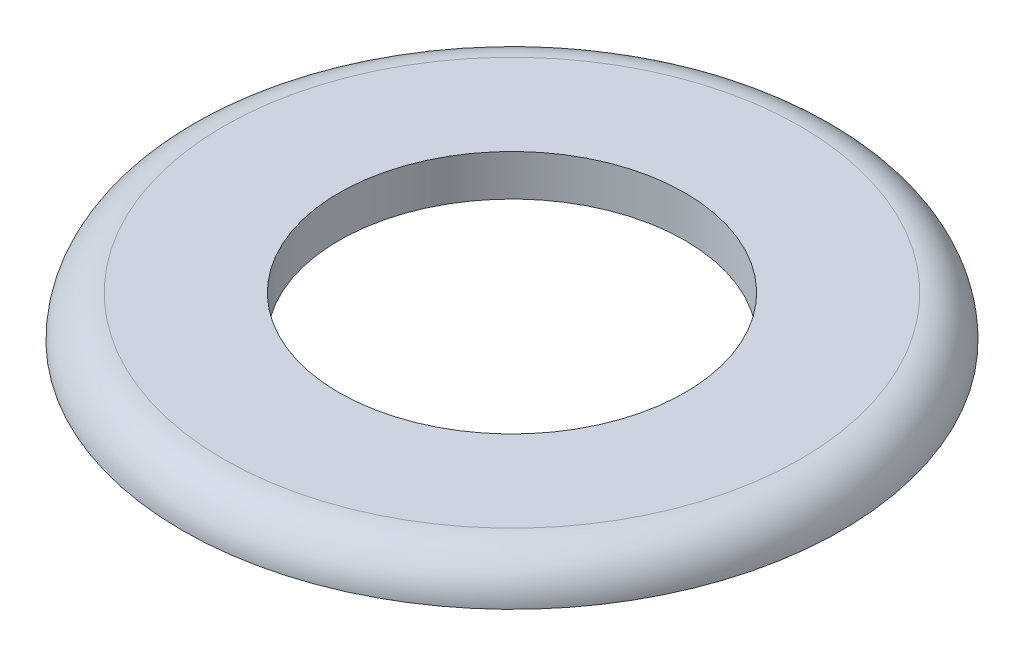
ISO-10303-21;
HEADER;
FILE_DESCRIPTION(('STEP AP214'),'2;1');
FILE_NAME('part.step','',(''),(''),'','','');
FILE_SCHEMA(('AUTOMOTIVE_DESIGN { 1 0 10303 214 1 1 1 1 }'));
ENDSEC;
DATA;
#1=APPLICATION_CONTEXT('core data for automotive mechanical design processes');
#2=APPLICATION_PROTOCOL_DEFINITION('international standard','automotive_design',2000,#1);
#3=PRODUCT_CONTEXT('',#1,'mechanical');
#4=PRODUCT('Part','Part','',(#3));
#5=PRODUCT_RELATED_PRODUCT_CATEGORY('part','',(#4));
#6=PRODUCT_DEFINITION_FORMATION('','',#4);
#7=PRODUCT_DEFINITION_CONTEXT('part definition',#1,'design');
#8=PRODUCT_DEFINITION('design','',#6,#7);
#9=PRODUCT_DEFINITION_SHAPE('','',#8);
#10=(LENGTH_UNIT() NAMED_UNIT(*) SI_UNIT(.MILLI.,.METRE.));
#11=(NAMED_UNIT(*) PLANE_ANGLE_UNIT() SI_UNIT($,.RADIAN.));
#12=(NAMED_UNIT(*) SI_UNIT($,.STERADIAN.) SOLID_ANGLE_UNIT());
#13=UNCERTAINTY_MEASURE_WITH_UNIT(LENGTH_MEASURE(1.E-05),#10,'distance_accuracy_value','');
#14=(GEOMETRIC_REPRESENTATION_CONTEXT(3) GLOBAL_UNCERTAINTY_ASSIGNED_CONTEXT((#13)) GLOBAL_UNIT_ASSIGNED_CONTEXT((#10,
#11,#12)) REPRESENTATION_CONTEXT('',''));
#15=CARTESIAN_POINT('',(0.,0.,0.));
#16=DIRECTION('',(0.,0.,1.));
#17=DIRECTION('',(1.,0.,0.));
#18=AXIS2_PLACEMENT_3D('',#15,#16,#17);
#19=CARTESIAN_POINT('',(0.,0.5,0.));
#20=DIRECTION('',(0.,1.,0.));
#21=DIRECTION('',(0.,0.,1.));
#22=AXIS2_PLACEMENT_3D('',#19,#20,#21);
#23=PLANE('',#22);
#24=CARTESIAN_POINT('',(0.,0.5,0.));
#25=DIRECTION('',(0.,1.,0.));
#26=DIRECTION('',(0.,0.,1.));
#27=AXIS2_PLACEMENT_3D('',#24,#25,#26);
#28=CIRCLE('',#27,3.5);
#29=CARTESIAN_POINT('',(0.,0.5,3.5));
#30=VERTEX_POINT('',#29);
#31=EDGE_CURVE('E10',#30,#30,#28,.T.);
#32=ORIENTED_EDGE('',*,*,#31,.T.);
#33=EDGE_LOOP('',(#32));
#34=FACE_BOUND('',#33,.T.);
#35=CARTESIAN_POINT('',(0.,0.5,0.));
#36=DIRECTION('',(0.,1.,0.));
#37=DIRECTION('',(0.,0.,1.));
#38=AXIS2_PLACEMENT_3D('',#35,#36,#37);
#39=CIRCLE('',#38,2.1);
#40=CARTESIAN_POINT('',(0.,0.5,2.1));
#41=VERTEX_POINT('',#40);
#42=EDGE_CURVE('E54',#41,#41,#39,.T.);
#43=ORIENTED_EDGE('',*,*,#42,.F.);
#44=EDGE_LOOP('',(#43));
#45=FACE_BOUND('',#44,.T.);
#46=ADVANCED_FACE('F41',(#34,#45),#23,.T.);
#47=CARTESIAN_POINT('',(0.,0.,0.));
#48=DIRECTION('',(0.,1.,0.));
#49=DIRECTION('',(0.,0.,1.));
#50=AXIS2_PLACEMENT_3D('',#47,#48,#49);
#51=PLANE('',#50);
#52=CARTESIAN_POINT('',(0.,0.,0.));
#53=DIRECTION('',(0.,1.,0.));
#54=DIRECTION('',(0.,0.,1.));
#55=AXIS2_PLACEMENT_3D('',#52,#53,#54);
#56=CIRCLE('',#55,4.);
#57=CARTESIAN_POINT('',(0.,0.,4.));
#58=VERTEX_POINT('',#57);
#59=EDGE_CURVE('E49',#58,#58,#56,.T.);
#60=ORIENTED_EDGE('',*,*,#59,.F.);
#61=EDGE_LOOP('',(#60));
#62=FACE_BOUND('',#61,.T.);
#63=CARTESIAN_POINT('',(0.,0.,0.));
#64=DIRECTION('',(0.,1.,0.));
#65=DIRECTION('',(0.,0.,1.));
#66=AXIS2_PLACEMENT_3D('',#63,#64,#65);
#67=CIRCLE('',#66,2.1);
#68=CARTESIAN_POINT('',(0.,0.,2.1));
#69=VERTEX_POINT('',#68);
#70=EDGE_CURVE('E59',#69,#69,#67,.T.);
#71=ORIENTED_EDGE('',*,*,#70,.T.);
#72=EDGE_LOOP('',(#71));
#73=FACE_BOUND('',#72,.T.);
#74=ADVANCED_FACE('F66',(#62,#73),#51,.F.);
#75=CARTESIAN_POINT('',(0.,0.5,0.));
#76=DIRECTION('',(0.,-1.,0.));
#77=DIRECTION('',(0.,0.,-1.));
#78=AXIS2_PLACEMENT_3D('',#75,#76,#77);
#79=CYLINDRICAL_SURFACE('',#78,2.1);
#80=ORIENTED_EDGE('',*,*,#42,.T.);
#81=EDGE_LOOP('',(#80));
#82=FACE_BOUND('',#81,.T.);
#83=ORIENTED_EDGE('',*,*,#70,.F.);
#84=EDGE_LOOP('',(#83));
#85=FACE_BOUND('',#84,.T.);
#86=ADVANCED_FACE('F68',(#82,#85),#79,.F.);
#87=CARTESIAN_POINT('',(0.,0.,0.));
#88=DIRECTION('',(0.,1.,0.));
#89=DIRECTION('',(0.,0.,1.));
#90=AXIS2_PLACEMENT_3D('',#87,#88,#89);
#91=TOROIDAL_SURFACE('',#90,3.5,0.5);
#92=ORIENTED_EDGE('',*,*,#59,.T.);
#93=EDGE_LOOP('',(#92));
#94=FACE_BOUND('',#93,.T.);
#95=ORIENTED_EDGE('',*,*,#31,.F.);
#96=EDGE_LOOP('',(#95));
#97=FACE_BOUND('',#96,.T.);
#98=ADVANCED_FACE('F43',(#94,#97),#91,.T.);
#99=CLOSED_SHELL('',(#46,#74,#86,#98));
#100=MANIFOLD_SOLID_BREP('B2',#99);
#101=ADVANCED_BREP_SHAPE_REPRESENTATION('',(#18,#100),#14);
#102=SHAPE_DEFINITION_REPRESENTATION(#9,#101);
ENDSEC;
END-ISO-10303-21;
